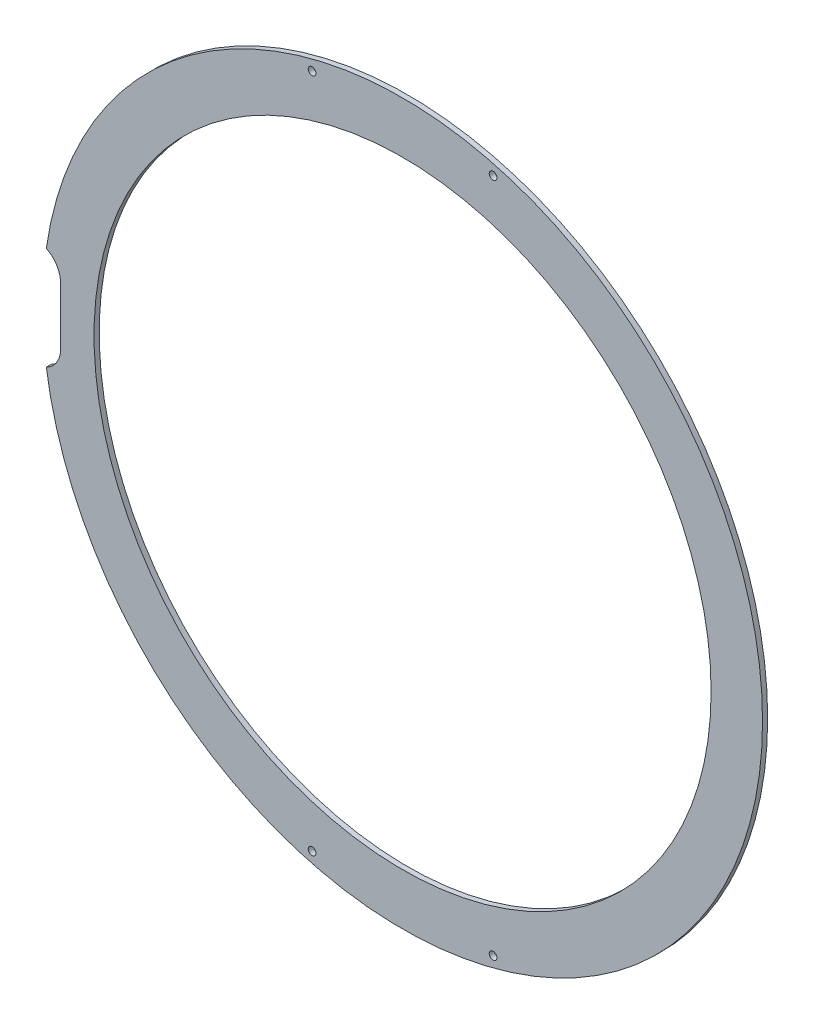
ISO-10303-21;
HEADER;
FILE_DESCRIPTION(('STEP AP214'),'2;1');
FILE_NAME('part.step','',(''),(''),'','','');
FILE_SCHEMA(('AUTOMOTIVE_DESIGN { 1 0 10303 214 1 1 1 1 }'));
ENDSEC;
DATA;
#1=APPLICATION_CONTEXT('core data for automotive mechanical design processes');
#2=APPLICATION_PROTOCOL_DEFINITION('international standard','automotive_design',2000,#1);
#3=PRODUCT_CONTEXT('',#1,'mechanical');
#4=PRODUCT('Part','Part','',(#3));
#5=PRODUCT_RELATED_PRODUCT_CATEGORY('part','',(#4));
#6=PRODUCT_DEFINITION_FORMATION('','',#4);
#7=PRODUCT_DEFINITION_CONTEXT('part definition',#1,'design');
#8=PRODUCT_DEFINITION('design','',#6,#7);
#9=PRODUCT_DEFINITION_SHAPE('','',#8);
#10=(LENGTH_UNIT() NAMED_UNIT(*) SI_UNIT(.MILLI.,.METRE.));
#11=(NAMED_UNIT(*) PLANE_ANGLE_UNIT() SI_UNIT($,.RADIAN.));
#12=(NAMED_UNIT(*) SI_UNIT($,.STERADIAN.) SOLID_ANGLE_UNIT());
#13=UNCERTAINTY_MEASURE_WITH_UNIT(LENGTH_MEASURE(1.E-05),#10,'distance_accuracy_value','');
#14=(GEOMETRIC_REPRESENTATION_CONTEXT(3) GLOBAL_UNCERTAINTY_ASSIGNED_CONTEXT((#13)) GLOBAL_UNIT_ASSIGNED_CONTEXT((#10,
#11,#12)) REPRESENTATION_CONTEXT('',''));
#15=CARTESIAN_POINT('',(0.,0.,0.));
#16=DIRECTION('',(0.,0.,1.));
#17=DIRECTION('',(1.,0.,0.));
#18=AXIS2_PLACEMENT_3D('',#15,#16,#17);
#19=CARTESIAN_POINT('',(0.,0.,2.));
#20=DIRECTION('',(0.,0.,1.));
#21=DIRECTION('',(1.,0.,0.));
#22=AXIS2_PLACEMENT_3D('',#19,#20,#21);
#23=PLANE('',#22);
#24=CARTESIAN_POINT('',(35.1993901339425,-131.365912375313,2.));
#25=DIRECTION('',(0.,0.,1.));
#26=DIRECTION('',(1.,0.,0.));
#27=AXIS2_PLACEMENT_3D('',#24,#25,#26);
#28=CIRCLE('',#27,1.5);
#29=CARTESIAN_POINT('',(36.6993901339425,-131.365912375313,2.));
#30=VERTEX_POINT('',#29);
#31=EDGE_CURVE('E182',#30,#30,#28,.T.);
#32=ORIENTED_EDGE('',*,*,#31,.F.);
#33=EDGE_LOOP('',(#32));
#34=FACE_BOUND('',#33,.T.);
#35=CARTESIAN_POINT('',(-35.1993901339425,131.365912375313,2.));
#36=DIRECTION('',(0.,0.,1.));
#37=DIRECTION('',(1.,0.,0.));
#38=AXIS2_PLACEMENT_3D('',#35,#36,#37);
#39=CIRCLE('',#38,1.5);
#40=CARTESIAN_POINT('',(-33.6993901339425,131.365912375313,2.));
#41=VERTEX_POINT('',#40);
#42=EDGE_CURVE('E183',#41,#41,#39,.T.);
#43=ORIENTED_EDGE('',*,*,#42,.F.);
#44=EDGE_LOOP('',(#43));
#45=FACE_BOUND('',#44,.T.);
#46=CARTESIAN_POINT('',(35.1993901339434,131.365912375313,2.));
#47=DIRECTION('',(0.,0.,1.));
#48=DIRECTION('',(1.,0.,0.));
#49=AXIS2_PLACEMENT_3D('',#46,#47,#48);
#50=CIRCLE('',#49,1.5);
#51=CARTESIAN_POINT('',(36.6993901339434,131.365912375313,2.));
#52=VERTEX_POINT('',#51);
#53=EDGE_CURVE('E197',#52,#52,#50,.T.);
#54=ORIENTED_EDGE('',*,*,#53,.F.);
#55=EDGE_LOOP('',(#54));
#56=FACE_BOUND('',#55,.T.);
#57=CARTESIAN_POINT('',(-35.1993901339434,-131.365912375313,2.));
#58=DIRECTION('',(0.,0.,1.));
#59=DIRECTION('',(1.,0.,0.));
#60=AXIS2_PLACEMENT_3D('',#57,#58,#59);
#61=CIRCLE('',#60,1.5);
#62=CARTESIAN_POINT('',(-33.6993901339434,-131.365912375313,2.));
#63=VERTEX_POINT('',#62);
#64=EDGE_CURVE('E173',#63,#63,#61,.T.);
#65=ORIENTED_EDGE('',*,*,#64,.F.);
#66=EDGE_LOOP('',(#65));
#67=FACE_BOUND('',#66,.T.);
#68=CARTESIAN_POINT('',(0.,0.,2.));
#69=DIRECTION('',(0.,0.,1.));
#70=DIRECTION('',(1.,0.,0.));
#71=AXIS2_PLACEMENT_3D('',#68,#69,#70);
#72=CIRCLE('',#71,140.);
#73=CARTESIAN_POINT('',(-138.56406460551,-20.,2.));
#74=VERTEX_POINT('',#73);
#75=CARTESIAN_POINT('',(-138.56406460551,20.,2.));
#76=VERTEX_POINT('',#75);
#77=EDGE_CURVE('E93',#74,#76,#72,.T.);
#78=ORIENTED_EDGE('',*,*,#77,.T.);
#79=CARTESIAN_POINT('',(-143.,11.0377191978876,2.));
#80=DIRECTION('',(0.,0.,1.));
#81=DIRECTION('',(1.,0.,0.));
#82=AXIS2_PLACEMENT_3D('',#79,#80,#81);
#83=CIRCLE('',#82,10.);
#84=CARTESIAN_POINT('',(-133.,11.0377191978876,2.));
#85=VERTEX_POINT('',#84);
#86=EDGE_CURVE('E50',#76,#85,#83,.F.);
#87=ORIENTED_EDGE('',*,*,#86,.T.);
#88=DIRECTION('',(0.,1.,0.));
#89=VECTOR('',#88,1.);
#90=CARTESIAN_POINT('',(-133.,-20.,2.));
#91=LINE('',#90,#89);
#92=CARTESIAN_POINT('',(-133.,-11.0377191978876,2.));
#93=VERTEX_POINT('',#92);
#94=EDGE_CURVE('E127',#93,#85,#91,.T.);
#95=ORIENTED_EDGE('',*,*,#94,.F.);
#96=CARTESIAN_POINT('',(-143.,-11.0377191978876,2.));
#97=DIRECTION('',(0.,0.,1.));
#98=DIRECTION('',(1.,0.,0.));
#99=AXIS2_PLACEMENT_3D('',#96,#97,#98);
#100=CIRCLE('',#99,10.);
#101=EDGE_CURVE('E64',#93,#74,#100,.F.);
#102=ORIENTED_EDGE('',*,*,#101,.T.);
#103=EDGE_LOOP('',(#78,#87,#95,#102));
#104=FACE_BOUND('',#103,.T.);
#105=CARTESIAN_POINT('',(0.,0.,2.));
#106=DIRECTION('',(0.,0.,1.));
#107=DIRECTION('',(1.,0.,0.));
#108=AXIS2_PLACEMENT_3D('',#105,#106,#107);
#109=CIRCLE('',#108,120.);
#110=CARTESIAN_POINT('',(120.,0.,2.));
#111=VERTEX_POINT('',#110);
#112=EDGE_CURVE('E107',#111,#111,#109,.T.);
#113=ORIENTED_EDGE('',*,*,#112,.F.);
#114=EDGE_LOOP('',(#113));
#115=FACE_BOUND('',#114,.T.);
#116=ADVANCED_FACE('F41',(#34,#45,#56,#67,#104,#115),#23,.T.);
#117=CARTESIAN_POINT('',(0.,0.,0.));
#118=DIRECTION('',(0.,0.,1.));
#119=DIRECTION('',(1.,0.,0.));
#120=AXIS2_PLACEMENT_3D('',#117,#118,#119);
#121=PLANE('',#120);
#122=CARTESIAN_POINT('',(35.1993901339425,-131.365912375313,0.));
#123=DIRECTION('',(0.,0.,1.));
#124=DIRECTION('',(1.,0.,0.));
#125=AXIS2_PLACEMENT_3D('',#122,#123,#124);
#126=CIRCLE('',#125,1.5);
#127=CARTESIAN_POINT('',(36.6993901339425,-131.365912375313,0.));
#128=VERTEX_POINT('',#127);
#129=EDGE_CURVE('E177',#128,#128,#126,.F.);
#130=ORIENTED_EDGE('',*,*,#129,.F.);
#131=EDGE_LOOP('',(#130));
#132=FACE_BOUND('',#131,.T.);
#133=CARTESIAN_POINT('',(-35.1993901339425,131.365912375313,0.));
#134=DIRECTION('',(0.,0.,1.));
#135=DIRECTION('',(1.,0.,0.));
#136=AXIS2_PLACEMENT_3D('',#133,#134,#135);
#137=CIRCLE('',#136,1.5);
#138=CARTESIAN_POINT('',(-33.6993901339425,131.365912375313,0.));
#139=VERTEX_POINT('',#138);
#140=EDGE_CURVE('E178',#139,#139,#137,.F.);
#141=ORIENTED_EDGE('',*,*,#140,.F.);
#142=EDGE_LOOP('',(#141));
#143=FACE_BOUND('',#142,.T.);
#144=CARTESIAN_POINT('',(35.1993901339434,131.365912375313,0.));
#145=DIRECTION('',(0.,0.,1.));
#146=DIRECTION('',(1.,0.,0.));
#147=AXIS2_PLACEMENT_3D('',#144,#145,#146);
#148=CIRCLE('',#147,1.5);
#149=CARTESIAN_POINT('',(36.6993901339434,131.365912375313,0.));
#150=VERTEX_POINT('',#149);
#151=EDGE_CURVE('E187',#150,#150,#148,.F.);
#152=ORIENTED_EDGE('',*,*,#151,.F.);
#153=EDGE_LOOP('',(#152));
#154=FACE_BOUND('',#153,.T.);
#155=CARTESIAN_POINT('',(-35.1993901339434,-131.365912375313,0.));
#156=DIRECTION('',(0.,0.,1.));
#157=DIRECTION('',(1.,0.,0.));
#158=AXIS2_PLACEMENT_3D('',#155,#156,#157);
#159=CIRCLE('',#158,1.5);
#160=CARTESIAN_POINT('',(-33.6993901339434,-131.365912375313,0.));
#161=VERTEX_POINT('',#160);
#162=EDGE_CURVE('E169',#161,#161,#159,.F.);
#163=ORIENTED_EDGE('',*,*,#162,.F.);
#164=EDGE_LOOP('',(#163));
#165=FACE_BOUND('',#164,.T.);
#166=DIRECTION('',(0.,-1.,0.));
#167=VECTOR('',#166,1.);
#168=CARTESIAN_POINT('',(-133.,-20.,0.));
#169=LINE('',#168,#167);
#170=CARTESIAN_POINT('',(-133.,11.0377191978876,0.));
#171=VERTEX_POINT('',#170);
#172=CARTESIAN_POINT('',(-133.,-11.0377191978876,0.));
#173=VERTEX_POINT('',#172);
#174=EDGE_CURVE('E97',#171,#173,#169,.T.);
#175=ORIENTED_EDGE('',*,*,#174,.F.);
#176=CARTESIAN_POINT('',(-143.,11.0377191978876,0.));
#177=DIRECTION('',(0.,0.,1.));
#178=DIRECTION('',(1.,0.,0.));
#179=AXIS2_PLACEMENT_3D('',#176,#177,#178);
#180=CIRCLE('',#179,10.);
#181=CARTESIAN_POINT('',(-138.56406460551,20.,0.));
#182=VERTEX_POINT('',#181);
#183=EDGE_CURVE('E11',#171,#182,#180,.T.);
#184=ORIENTED_EDGE('',*,*,#183,.T.);
#185=CARTESIAN_POINT('',(0.,0.,0.));
#186=DIRECTION('',(0.,0.,1.));
#187=DIRECTION('',(1.,0.,0.));
#188=AXIS2_PLACEMENT_3D('',#185,#186,#187);
#189=CIRCLE('',#188,140.);
#190=CARTESIAN_POINT('',(-138.56406460551,-20.,0.));
#191=VERTEX_POINT('',#190);
#192=EDGE_CURVE('E95',#191,#182,#189,.T.);
#193=ORIENTED_EDGE('',*,*,#192,.F.);
#194=CARTESIAN_POINT('',(-143.,-11.0377191978876,0.));
#195=DIRECTION('',(0.,0.,1.));
#196=DIRECTION('',(1.,0.,0.));
#197=AXIS2_PLACEMENT_3D('',#194,#195,#196);
#198=CIRCLE('',#197,10.);
#199=EDGE_CURVE('E88',#191,#173,#198,.T.);
#200=ORIENTED_EDGE('',*,*,#199,.T.);
#201=EDGE_LOOP('',(#175,#184,#193,#200));
#202=FACE_BOUND('',#201,.T.);
#203=CARTESIAN_POINT('',(0.,0.,0.));
#204=DIRECTION('',(0.,0.,1.));
#205=DIRECTION('',(1.,0.,0.));
#206=AXIS2_PLACEMENT_3D('',#203,#204,#205);
#207=CIRCLE('',#206,120.);
#208=CARTESIAN_POINT('',(120.,0.,0.));
#209=VERTEX_POINT('',#208);
#210=EDGE_CURVE('E110',#209,#209,#207,.T.);
#211=ORIENTED_EDGE('',*,*,#210,.T.);
#212=EDGE_LOOP('',(#211));
#213=FACE_BOUND('',#212,.T.);
#214=ADVANCED_FACE('F122',(#132,#143,#154,#165,#202,#213),#121,.F.);
#215=CARTESIAN_POINT('',(0.,0.,2.));
#216=DIRECTION('',(0.,0.,-1.));
#217=DIRECTION('',(-1.,0.,0.));
#218=AXIS2_PLACEMENT_3D('',#215,#216,#217);
#219=CYLINDRICAL_SURFACE('',#218,140.);
#220=ORIENTED_EDGE('',*,*,#192,.T.);
#221=DIRECTION('',(0.,0.,-1.));
#222=VECTOR('',#221,1.);
#223=CARTESIAN_POINT('',(-138.56406460551,20.,2.));
#224=LINE('',#223,#222);
#225=EDGE_CURVE('E85',#76,#182,#224,.T.);
#226=ORIENTED_EDGE('',*,*,#225,.F.);
#227=ORIENTED_EDGE('',*,*,#77,.F.);
#228=DIRECTION('',(0.,0.,-1.));
#229=VECTOR('',#228,1.);
#230=CARTESIAN_POINT('',(-138.56406460551,-20.,2.));
#231=LINE('',#230,#229);
#232=EDGE_CURVE('E98',#191,#74,#231,.F.);
#233=ORIENTED_EDGE('',*,*,#232,.F.);
#234=EDGE_LOOP('',(#220,#226,#227,#233));
#235=FACE_BOUND('',#234,.T.);
#236=ADVANCED_FACE('F92',(#235),#219,.T.);
#237=CARTESIAN_POINT('',(0.,0.,2.));
#238=DIRECTION('',(0.,0.,-1.));
#239=DIRECTION('',(-1.,0.,0.));
#240=AXIS2_PLACEMENT_3D('',#237,#238,#239);
#241=CYLINDRICAL_SURFACE('',#240,120.);
#242=ORIENTED_EDGE('',*,*,#112,.T.);
#243=EDGE_LOOP('',(#242));
#244=FACE_BOUND('',#243,.T.);
#245=ORIENTED_EDGE('',*,*,#210,.F.);
#246=EDGE_LOOP('',(#245));
#247=FACE_BOUND('',#246,.T.);
#248=ADVANCED_FACE('F136',(#244,#247),#241,.F.);
#249=CARTESIAN_POINT('',(-133.,-20.,-0.00100000000000013));
#250=DIRECTION('',(1.,0.,0.));
#251=DIRECTION('',(0.,0.,-1.));
#252=AXIS2_PLACEMENT_3D('',#249,#250,#251);
#253=PLANE('',#252);
#254=ORIENTED_EDGE('',*,*,#174,.T.);
#255=DIRECTION('',(0.,0.,-1.));
#256=VECTOR('',#255,1.);
#257=CARTESIAN_POINT('',(-133.,-11.0377191978876,-0.00100000000000013));
#258=LINE('',#257,#256);
#259=EDGE_CURVE('E105',#173,#93,#258,.F.);
#260=ORIENTED_EDGE('',*,*,#259,.T.);
#261=ORIENTED_EDGE('',*,*,#94,.T.);
#262=DIRECTION('',(0.,0.,-1.));
#263=VECTOR('',#262,1.);
#264=CARTESIAN_POINT('',(-133.,11.0377191978876,-0.00100000000000013));
#265=LINE('',#264,#263);
#266=EDGE_CURVE('E86',#85,#171,#265,.T.);
#267=ORIENTED_EDGE('',*,*,#266,.T.);
#268=EDGE_LOOP('',(#254,#260,#261,#267));
#269=FACE_BOUND('',#268,.T.);
#270=ADVANCED_FACE('F125',(#269),#253,.F.);
#271=CARTESIAN_POINT('',(-143.,-11.0377191978876,2.));
#272=DIRECTION('',(0.,0.,-1.));
#273=DIRECTION('',(-1.,0.,0.));
#274=AXIS2_PLACEMENT_3D('',#271,#272,#273);
#275=CYLINDRICAL_SURFACE('',#274,10.);
#276=ORIENTED_EDGE('',*,*,#199,.F.);
#277=ORIENTED_EDGE('',*,*,#232,.T.);
#278=ORIENTED_EDGE('',*,*,#101,.F.);
#279=ORIENTED_EDGE('',*,*,#259,.F.);
#280=EDGE_LOOP('',(#276,#277,#278,#279));
#281=FACE_BOUND('',#280,.T.);
#282=ADVANCED_FACE('F129',(#281),#275,.F.);
#283=CARTESIAN_POINT('',(-143.,11.0377191978876,2.));
#284=DIRECTION('',(0.,0.,-1.));
#285=DIRECTION('',(-1.,0.,0.));
#286=AXIS2_PLACEMENT_3D('',#283,#284,#285);
#287=CYLINDRICAL_SURFACE('',#286,10.);
#288=ORIENTED_EDGE('',*,*,#183,.F.);
#289=ORIENTED_EDGE('',*,*,#266,.F.);
#290=ORIENTED_EDGE('',*,*,#86,.F.);
#291=ORIENTED_EDGE('',*,*,#225,.T.);
#292=EDGE_LOOP('',(#288,#289,#290,#291));
#293=FACE_BOUND('',#292,.T.);
#294=ADVANCED_FACE('F43',(#293),#287,.F.);
#295=CARTESIAN_POINT('',(-35.1993901339434,-131.365912375313,-0.00100000000000013));
#296=DIRECTION('',(0.,0.,1.));
#297=DIRECTION('',(1.,0.,0.));
#298=AXIS2_PLACEMENT_3D('',#295,#296,#297);
#299=CYLINDRICAL_SURFACE('',#298,1.5);
#300=ORIENTED_EDGE('',*,*,#64,.T.);
#301=EDGE_LOOP('',(#300));
#302=FACE_BOUND('',#301,.T.);
#303=ORIENTED_EDGE('',*,*,#162,.T.);
#304=EDGE_LOOP('',(#303));
#305=FACE_BOUND('',#304,.T.);
#306=ADVANCED_FACE('F135',(#302,#305),#299,.F.);
#307=CARTESIAN_POINT('',(35.1993901339434,131.365912375313,-0.00100000000000013));
#308=DIRECTION('',(0.,0.,1.));
#309=DIRECTION('',(1.,0.,0.));
#310=AXIS2_PLACEMENT_3D('',#307,#308,#309);
#311=CYLINDRICAL_SURFACE('',#310,1.5);
#312=ORIENTED_EDGE('',*,*,#53,.T.);
#313=EDGE_LOOP('',(#312));
#314=FACE_BOUND('',#313,.T.);
#315=ORIENTED_EDGE('',*,*,#151,.T.);
#316=EDGE_LOOP('',(#315));
#317=FACE_BOUND('',#316,.T.);
#318=ADVANCED_FACE('F202',(#314,#317),#311,.F.);
#319=CARTESIAN_POINT('',(-35.1993901339425,131.365912375313,-0.00100000000000013));
#320=DIRECTION('',(0.,0.,1.));
#321=DIRECTION('',(1.,0.,0.));
#322=AXIS2_PLACEMENT_3D('',#319,#320,#321);
#323=CYLINDRICAL_SURFACE('',#322,1.5);
#324=ORIENTED_EDGE('',*,*,#42,.T.);
#325=EDGE_LOOP('',(#324));
#326=FACE_BOUND('',#325,.T.);
#327=ORIENTED_EDGE('',*,*,#140,.T.);
#328=EDGE_LOOP('',(#327));
#329=FACE_BOUND('',#328,.T.);
#330=ADVANCED_FACE('F216',(#326,#329),#323,.F.);
#331=CARTESIAN_POINT('',(35.1993901339425,-131.365912375313,-0.00100000000000013));
#332=DIRECTION('',(0.,0.,1.));
#333=DIRECTION('',(1.,0.,0.));
#334=AXIS2_PLACEMENT_3D('',#331,#332,#333);
#335=CYLINDRICAL_SURFACE('',#334,1.5);
#336=ORIENTED_EDGE('',*,*,#31,.T.);
#337=EDGE_LOOP('',(#336));
#338=FACE_BOUND('',#337,.T.);
#339=ORIENTED_EDGE('',*,*,#129,.T.);
#340=EDGE_LOOP('',(#339));
#341=FACE_BOUND('',#340,.T.);
#342=ADVANCED_FACE('F221',(#338,#341),#335,.F.);
#343=CLOSED_SHELL('',(#116,#214,#236,#248,#270,#282,#294,#306,#318,#330,#342));
#344=MANIFOLD_SOLID_BREP('B2',#343);
#345=ADVANCED_BREP_SHAPE_REPRESENTATION('',(#18,#344),#14);
#346=SHAPE_DEFINITION_REPRESENTATION(#9,#345);
ENDSEC;
END-ISO-10303-21;
